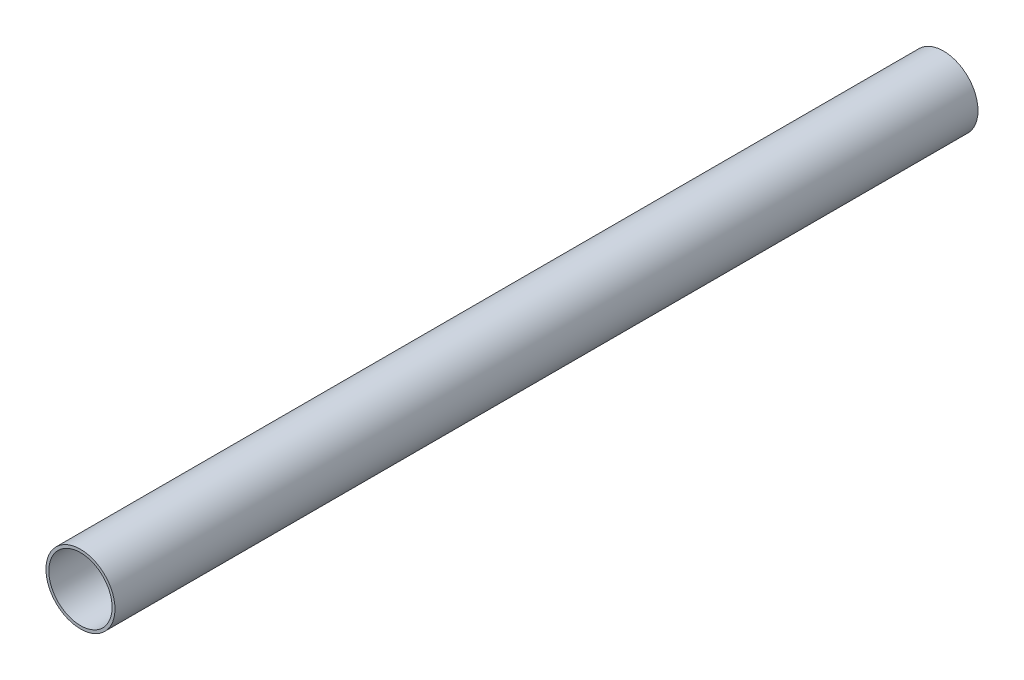
ISO-10303-21;
HEADER;
FILE_DESCRIPTION(('STEP AP214'),'2;1');
FILE_NAME('part.step','',(''),(''),'','','');
FILE_SCHEMA(('AUTOMOTIVE_DESIGN { 1 0 10303 214 1 1 1 1 }'));
ENDSEC;
DATA;
#1=APPLICATION_CONTEXT('core data for automotive mechanical design processes');
#2=APPLICATION_PROTOCOL_DEFINITION('international standard','automotive_design',2000,#1);
#3=PRODUCT_CONTEXT('',#1,'mechanical');
#4=PRODUCT('Part','Part','',(#3));
#5=PRODUCT_RELATED_PRODUCT_CATEGORY('part','',(#4));
#6=PRODUCT_DEFINITION_FORMATION('','',#4);
#7=PRODUCT_DEFINITION_CONTEXT('part definition',#1,'design');
#8=PRODUCT_DEFINITION('design','',#6,#7);
#9=PRODUCT_DEFINITION_SHAPE('','',#8);
#10=(LENGTH_UNIT() NAMED_UNIT(*) SI_UNIT(.MILLI.,.METRE.));
#11=(NAMED_UNIT(*) PLANE_ANGLE_UNIT() SI_UNIT($,.RADIAN.));
#12=(NAMED_UNIT(*) SI_UNIT($,.STERADIAN.) SOLID_ANGLE_UNIT());
#13=UNCERTAINTY_MEASURE_WITH_UNIT(LENGTH_MEASURE(1.E-05),#10,'distance_accuracy_value','');
#14=(GEOMETRIC_REPRESENTATION_CONTEXT(3) GLOBAL_UNCERTAINTY_ASSIGNED_CONTEXT((#13)) GLOBAL_UNIT_ASSIGNED_CONTEXT((#10,
#11,#12)) REPRESENTATION_CONTEXT('',''));
#15=CARTESIAN_POINT('',(0.,0.,0.));
#16=DIRECTION('',(0.,0.,1.));
#17=DIRECTION('',(1.,0.,0.));
#18=AXIS2_PLACEMENT_3D('',#15,#16,#17);
#19=CARTESIAN_POINT('',(0.,0.,300.));
#20=DIRECTION('',(0.,0.,1.));
#21=DIRECTION('',(1.,0.,0.));
#22=AXIS2_PLACEMENT_3D('',#19,#20,#21);
#23=PLANE('',#22);
#24=CARTESIAN_POINT('',(0.,0.,300.));
#25=DIRECTION('',(0.,0.,1.));
#26=DIRECTION('',(1.,0.,0.));
#27=AXIS2_PLACEMENT_3D('',#24,#25,#26);
#28=CIRCLE('',#27,12.);
#29=CARTESIAN_POINT('',(12.,0.,300.));
#30=VERTEX_POINT('',#29);
#31=EDGE_CURVE('E10',#30,#30,#28,.T.);
#32=ORIENTED_EDGE('',*,*,#31,.T.);
#33=EDGE_LOOP('',(#32));
#34=FACE_BOUND('',#33,.T.);
#35=CARTESIAN_POINT('',(0.,0.,300.));
#36=DIRECTION('',(0.,0.,1.));
#37=DIRECTION('',(1.,0.,0.));
#38=AXIS2_PLACEMENT_3D('',#35,#36,#37);
#39=CIRCLE('',#38,11.);
#40=CARTESIAN_POINT('',(11.,0.,300.));
#41=VERTEX_POINT('',#40);
#42=EDGE_CURVE('E54',#41,#41,#39,.T.);
#43=ORIENTED_EDGE('',*,*,#42,.F.);
#44=EDGE_LOOP('',(#43));
#45=FACE_BOUND('',#44,.T.);
#46=ADVANCED_FACE('F41',(#34,#45),#23,.T.);
#47=CARTESIAN_POINT('',(0.,0.,0.));
#48=DIRECTION('',(0.,0.,1.));
#49=DIRECTION('',(1.,0.,0.));
#50=AXIS2_PLACEMENT_3D('',#47,#48,#49);
#51=PLANE('',#50);
#52=CARTESIAN_POINT('',(0.,0.,0.));
#53=DIRECTION('',(0.,0.,1.));
#54=DIRECTION('',(1.,0.,0.));
#55=AXIS2_PLACEMENT_3D('',#52,#53,#54);
#56=CIRCLE('',#55,12.);
#57=CARTESIAN_POINT('',(12.,0.,0.));
#58=VERTEX_POINT('',#57);
#59=EDGE_CURVE('E45',#58,#58,#56,.T.);
#60=ORIENTED_EDGE('',*,*,#59,.F.);
#61=EDGE_LOOP('',(#60));
#62=FACE_BOUND('',#61,.T.);
#63=CARTESIAN_POINT('',(0.,0.,0.));
#64=DIRECTION('',(0.,0.,1.));
#65=DIRECTION('',(1.,0.,0.));
#66=AXIS2_PLACEMENT_3D('',#63,#64,#65);
#67=CIRCLE('',#66,11.);
#68=CARTESIAN_POINT('',(11.,0.,0.));
#69=VERTEX_POINT('',#68);
#70=EDGE_CURVE('E56',#69,#69,#67,.T.);
#71=ORIENTED_EDGE('',*,*,#70,.T.);
#72=EDGE_LOOP('',(#71));
#73=FACE_BOUND('',#72,.T.);
#74=ADVANCED_FACE('F68',(#62,#73),#51,.F.);
#75=CARTESIAN_POINT('',(0.,0.,300.));
#76=DIRECTION('',(0.,0.,-1.));
#77=DIRECTION('',(-1.,0.,0.));
#78=AXIS2_PLACEMENT_3D('',#75,#76,#77);
#79=CYLINDRICAL_SURFACE('',#78,12.);
#80=ORIENTED_EDGE('',*,*,#31,.F.);
#81=EDGE_LOOP('',(#80));
#82=FACE_BOUND('',#81,.T.);
#83=ORIENTED_EDGE('',*,*,#59,.T.);
#84=EDGE_LOOP('',(#83));
#85=FACE_BOUND('',#84,.T.);
#86=ADVANCED_FACE('F43',(#82,#85),#79,.T.);
#87=CARTESIAN_POINT('',(0.,0.,300.));
#88=DIRECTION('',(0.,0.,-1.));
#89=DIRECTION('',(-1.,0.,0.));
#90=AXIS2_PLACEMENT_3D('',#87,#88,#89);
#91=CYLINDRICAL_SURFACE('',#90,11.);
#92=ORIENTED_EDGE('',*,*,#42,.T.);
#93=EDGE_LOOP('',(#92));
#94=FACE_BOUND('',#93,.T.);
#95=ORIENTED_EDGE('',*,*,#70,.F.);
#96=EDGE_LOOP('',(#95));
#97=FACE_BOUND('',#96,.T.);
#98=ADVANCED_FACE('F64',(#94,#97),#91,.F.);
#99=CLOSED_SHELL('',(#46,#74,#86,#98));
#100=MANIFOLD_SOLID_BREP('B2',#99);
#101=ADVANCED_BREP_SHAPE_REPRESENTATION('',(#18,#100),#14);
#102=SHAPE_DEFINITION_REPRESENTATION(#9,#101);
ENDSEC;
END-ISO-10303-21;
